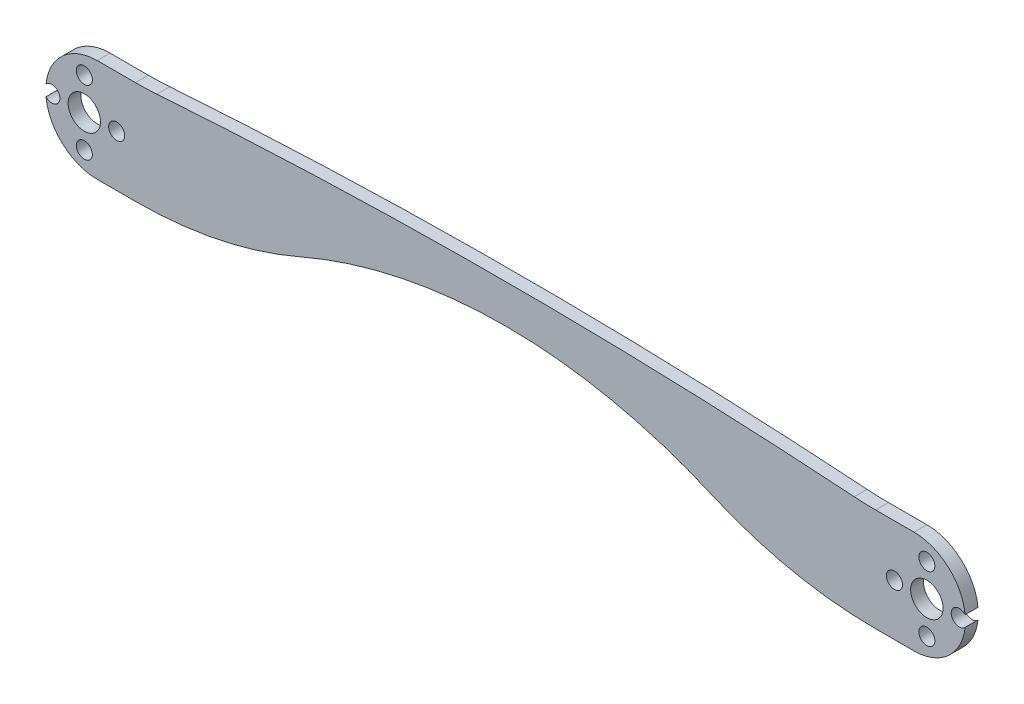
ISO-10303-21;
HEADER;
FILE_DESCRIPTION(('STEP AP214'),'2;1');
FILE_NAME('part.step','',(''),(''),'','','');
FILE_SCHEMA(('AUTOMOTIVE_DESIGN { 1 0 10303 214 1 1 1 1 }'));
ENDSEC;
DATA;
#1=APPLICATION_CONTEXT('core data for automotive mechanical design processes');
#2=APPLICATION_PROTOCOL_DEFINITION('international standard','automotive_design',2000,#1);
#3=PRODUCT_CONTEXT('',#1,'mechanical');
#4=PRODUCT('Part','Part','',(#3));
#5=PRODUCT_RELATED_PRODUCT_CATEGORY('part','',(#4));
#6=PRODUCT_DEFINITION_FORMATION('','',#4);
#7=PRODUCT_DEFINITION_CONTEXT('part definition',#1,'design');
#8=PRODUCT_DEFINITION('design','',#6,#7);
#9=PRODUCT_DEFINITION_SHAPE('','',#8);
#10=(LENGTH_UNIT() NAMED_UNIT(*) SI_UNIT(.MILLI.,.METRE.));
#11=(NAMED_UNIT(*) PLANE_ANGLE_UNIT() SI_UNIT($,.RADIAN.));
#12=(NAMED_UNIT(*) SI_UNIT($,.STERADIAN.) SOLID_ANGLE_UNIT());
#13=UNCERTAINTY_MEASURE_WITH_UNIT(LENGTH_MEASURE(1.E-05),#10,'distance_accuracy_value','');
#14=(GEOMETRIC_REPRESENTATION_CONTEXT(3) GLOBAL_UNCERTAINTY_ASSIGNED_CONTEXT((#13)) GLOBAL_UNIT_ASSIGNED_CONTEXT((#10,
#11,#12)) REPRESENTATION_CONTEXT('',''));
#15=CARTESIAN_POINT('',(0.,0.,0.));
#16=DIRECTION('',(0.,0.,1.));
#17=DIRECTION('',(1.,0.,0.));
#18=AXIS2_PLACEMENT_3D('',#15,#16,#17);
#19=CARTESIAN_POINT('',(0.,0.,3.175));
#20=DIRECTION('',(0.,0.,-1.));
#21=DIRECTION('',(-1.,0.,0.));
#22=AXIS2_PLACEMENT_3D('',#19,#20,#21);
#23=CYLINDRICAL_SURFACE('',#22,12.7);
#24=CARTESIAN_POINT('',(0.,0.,0.));
#25=DIRECTION('',(0.,0.,1.));
#26=DIRECTION('',(1.,0.,0.));
#27=AXIS2_PLACEMENT_3D('',#24,#25,#26);
#28=CIRCLE('',#27,12.7);
#29=CARTESIAN_POINT('',(0.,12.7,0.));
#30=VERTEX_POINT('',#29);
#31=CARTESIAN_POINT('',(-12.6278693896812,1.35163407664657,0.));
#32=VERTEX_POINT('',#31);
#33=EDGE_CURVE('E164',#30,#32,#28,.T.);
#34=ORIENTED_EDGE('',*,*,#33,.T.);
#35=DIRECTION('',(0.,0.,1.));
#36=VECTOR('',#35,1.);
#37=CARTESIAN_POINT('',(-12.6278693896812,1.35163407664658,1.5875));
#38=LINE('',#37,#36);
#39=CARTESIAN_POINT('',(-12.6278693896812,1.35163407664658,3.175));
#40=VERTEX_POINT('',#39);
#41=EDGE_CURVE('E50',#32,#40,#38,.T.);
#42=ORIENTED_EDGE('',*,*,#41,.T.);
#43=CARTESIAN_POINT('',(0.,0.,3.175));
#44=DIRECTION('',(0.,0.,1.));
#45=DIRECTION('',(1.,0.,0.));
#46=AXIS2_PLACEMENT_3D('',#43,#44,#45);
#47=CIRCLE('',#46,12.7);
#48=CARTESIAN_POINT('',(0.,12.7,3.175));
#49=VERTEX_POINT('',#48);
#50=EDGE_CURVE('E238',#49,#40,#47,.T.);
#51=ORIENTED_EDGE('',*,*,#50,.F.);
#52=DIRECTION('',(0.,0.,-1.));
#53=VECTOR('',#52,1.);
#54=CARTESIAN_POINT('',(0.,12.7,3.175));
#55=LINE('',#54,#53);
#56=EDGE_CURVE('E198',#49,#30,#55,.T.);
#57=ORIENTED_EDGE('',*,*,#56,.T.);
#58=EDGE_LOOP('',(#34,#42,#51,#57));
#59=FACE_BOUND('',#58,.T.);
#60=ADVANCED_FACE('F35',(#59),#23,.T.);
#61=CARTESIAN_POINT('',(201.650000052,0.,3.175));
#62=DIRECTION('',(0.,0.,-1.));
#63=DIRECTION('',(-1.,0.,0.));
#64=AXIS2_PLACEMENT_3D('',#61,#62,#63);
#65=CYLINDRICAL_SURFACE('',#64,12.7);
#66=CARTESIAN_POINT('',(201.650000052,0.,0.));
#67=DIRECTION('',(0.,0.,1.));
#68=DIRECTION('',(-1.,0.,0.));
#69=AXIS2_PLACEMENT_3D('',#66,#67,#68);
#70=CIRCLE('',#69,12.7);
#71=CARTESIAN_POINT('',(201.650000052,-12.7,0.));
#72=VERTEX_POINT('',#71);
#73=CARTESIAN_POINT('',(214.277869441681,-1.35163407664662,0.));
#74=VERTEX_POINT('',#73);
#75=EDGE_CURVE('E185',#72,#74,#70,.T.);
#76=ORIENTED_EDGE('',*,*,#75,.T.);
#77=DIRECTION('',(0.,0.,1.));
#78=VECTOR('',#77,1.);
#79=CARTESIAN_POINT('',(214.277869441681,-1.35163407664661,1.5875));
#80=LINE('',#79,#78);
#81=CARTESIAN_POINT('',(214.277869441681,-1.35163407664661,3.175));
#82=VERTEX_POINT('',#81);
#83=EDGE_CURVE('E57',#74,#82,#80,.T.);
#84=ORIENTED_EDGE('',*,*,#83,.T.);
#85=CARTESIAN_POINT('',(201.650000052,0.,3.175));
#86=DIRECTION('',(0.,0.,1.));
#87=DIRECTION('',(-1.,0.,0.));
#88=AXIS2_PLACEMENT_3D('',#85,#86,#87);
#89=CIRCLE('',#88,12.7);
#90=CARTESIAN_POINT('',(201.650000052,-12.7,3.175));
#91=VERTEX_POINT('',#90);
#92=EDGE_CURVE('E264',#91,#82,#89,.T.);
#93=ORIENTED_EDGE('',*,*,#92,.F.);
#94=DIRECTION('',(0.,0.,-1.));
#95=VECTOR('',#94,1.);
#96=CARTESIAN_POINT('',(201.650000052,-12.7,3.175));
#97=LINE('',#96,#95);
#98=EDGE_CURVE('E216',#91,#72,#97,.T.);
#99=ORIENTED_EDGE('',*,*,#98,.T.);
#100=EDGE_LOOP('',(#76,#84,#93,#99));
#101=FACE_BOUND('',#100,.T.);
#102=ADVANCED_FACE('F328',(#101),#65,.T.);
#103=CARTESIAN_POINT('',(-12.6278693896812,-1.35163407664664,3.175));
#104=VERTEX_POINT('',#103);
#105=CARTESIAN_POINT('',(0.,-12.7,3.175));
#106=VERTEX_POINT('',#105);
#107=EDGE_CURVE('E157',#104,#106,#47,.T.);
#108=ORIENTED_EDGE('',*,*,#107,.F.);
#109=DIRECTION('',(0.,0.,1.));
#110=VECTOR('',#109,1.);
#111=CARTESIAN_POINT('',(-12.6278693896812,-1.35163407664664,1.5875));
#112=LINE('',#111,#110);
#113=CARTESIAN_POINT('',(-12.6278693896812,-1.35163407664664,0.));
#114=VERTEX_POINT('',#113);
#115=EDGE_CURVE('E146',#104,#114,#112,.F.);
#116=ORIENTED_EDGE('',*,*,#115,.T.);
#117=CARTESIAN_POINT('',(0.,-12.7,0.));
#118=VERTEX_POINT('',#117);
#119=EDGE_CURVE('E155',#114,#118,#28,.T.);
#120=ORIENTED_EDGE('',*,*,#119,.T.);
#121=DIRECTION('',(0.,0.,-1.));
#122=VECTOR('',#121,1.);
#123=CARTESIAN_POINT('',(0.,-12.7,3.175));
#124=LINE('',#123,#122);
#125=EDGE_CURVE('E43',#106,#118,#124,.T.);
#126=ORIENTED_EDGE('',*,*,#125,.F.);
#127=EDGE_LOOP('',(#108,#116,#120,#126));
#128=FACE_BOUND('',#127,.T.);
#129=ADVANCED_FACE('F37',(#128),#23,.T.);
#130=CARTESIAN_POINT('',(9.46440950689287,-12.7,3.175));
#131=DIRECTION('',(0.,1.,0.));
#132=DIRECTION('',(-1.,0.,0.));
#133=AXIS2_PLACEMENT_3D('',#130,#131,#132);
#134=PLANE('',#133);
#135=DIRECTION('',(1.,0.,0.));
#136=VECTOR('',#135,1.);
#137=CARTESIAN_POINT('',(9.46440950689287,-12.7,0.));
#138=LINE('',#137,#136);
#139=CARTESIAN_POINT('',(9.46440950689287,-12.7,0.));
#140=VERTEX_POINT('',#139);
#141=EDGE_CURVE('E162',#118,#140,#138,.T.);
#142=ORIENTED_EDGE('',*,*,#141,.T.);
#143=DIRECTION('',(0.,0.,-1.));
#144=VECTOR('',#143,1.);
#145=CARTESIAN_POINT('',(9.46440950689287,-12.7,3.175));
#146=LINE('',#145,#144);
#147=CARTESIAN_POINT('',(9.46440950689287,-12.7,3.175));
#148=VERTEX_POINT('',#147);
#149=EDGE_CURVE('E228',#148,#140,#146,.T.);
#150=ORIENTED_EDGE('',*,*,#149,.F.);
#151=DIRECTION('',(1.,0.,0.));
#152=VECTOR('',#151,1.);
#153=CARTESIAN_POINT('',(9.46440950689287,-12.7,3.175));
#154=LINE('',#153,#152);
#155=EDGE_CURVE('E234',#106,#148,#154,.T.);
#156=ORIENTED_EDGE('',*,*,#155,.F.);
#157=ORIENTED_EDGE('',*,*,#125,.T.);
#158=EDGE_LOOP('',(#142,#150,#156,#157));
#159=FACE_BOUND('',#158,.T.);
#160=ADVANCED_FACE('F232',(#159),#134,.F.);
#161=CARTESIAN_POINT('',(9.46440950689286,88.9,3.175));
#162=DIRECTION('',(0.,0.,-1.));
#163=DIRECTION('',(-1.,0.,0.));
#164=AXIS2_PLACEMENT_3D('',#161,#162,#163);
#165=CYLINDRICAL_SURFACE('',#164,101.6);
#166=CARTESIAN_POINT('',(9.46440950689286,88.9,0.));
#167=DIRECTION('',(0.,0.,1.));
#168=DIRECTION('',(-1.,0.,0.));
#169=AXIS2_PLACEMENT_3D('',#166,#167,#168);
#170=CIRCLE('',#169,101.6);
#171=CARTESIAN_POINT('',(50.0691164042738,-4.23333333333338,0.));
#172=VERTEX_POINT('',#171);
#173=EDGE_CURVE('E176',#140,#172,#170,.T.);
#174=ORIENTED_EDGE('',*,*,#173,.T.);
#175=DIRECTION('',(0.,0.,-1.));
#176=VECTOR('',#175,1.);
#177=CARTESIAN_POINT('',(50.0691164042738,-4.23333333333338,3.175));
#178=LINE('',#177,#176);
#179=CARTESIAN_POINT('',(50.0691164042738,-4.23333333333338,3.175));
#180=VERTEX_POINT('',#179);
#181=EDGE_CURVE('E225',#180,#172,#178,.T.);
#182=ORIENTED_EDGE('',*,*,#181,.F.);
#183=CARTESIAN_POINT('',(9.46440950689286,88.9,3.175));
#184=DIRECTION('',(0.,0.,1.));
#185=DIRECTION('',(-1.,0.,0.));
#186=AXIS2_PLACEMENT_3D('',#183,#184,#185);
#187=CIRCLE('',#186,101.6);
#188=EDGE_CURVE('E237',#148,#180,#187,.T.);
#189=ORIENTED_EDGE('',*,*,#188,.F.);
#190=ORIENTED_EDGE('',*,*,#149,.T.);
#191=EDGE_LOOP('',(#174,#182,#189,#190));
#192=FACE_BOUND('',#191,.T.);
#193=ADVANCED_FACE('F340',(#192),#165,.T.);
#194=CARTESIAN_POINT('',(100.825000026,-120.65,3.175));
#195=DIRECTION('',(0.,0.,-1.));
#196=DIRECTION('',(-1.,0.,0.));
#197=AXIS2_PLACEMENT_3D('',#194,#195,#196);
#198=CYLINDRICAL_SURFACE('',#197,127.);
#199=CARTESIAN_POINT('',(100.825000026,-120.65,0.));
#200=DIRECTION('',(0.,0.,-1.));
#201=DIRECTION('',(-1.,0.,0.));
#202=AXIS2_PLACEMENT_3D('',#199,#200,#201);
#203=CIRCLE('',#202,127.);
#204=CARTESIAN_POINT('',(151.580883647726,-4.23333333333331,0.));
#205=VERTEX_POINT('',#204);
#206=EDGE_CURVE('E178',#172,#205,#203,.T.);
#207=ORIENTED_EDGE('',*,*,#206,.T.);
#208=DIRECTION('',(0.,0.,-1.));
#209=VECTOR('',#208,1.);
#210=CARTESIAN_POINT('',(151.580883647726,-4.23333333333331,3.175));
#211=LINE('',#210,#209);
#212=CARTESIAN_POINT('',(151.580883647726,-4.23333333333331,3.175));
#213=VERTEX_POINT('',#212);
#214=EDGE_CURVE('E222',#213,#205,#211,.T.);
#215=ORIENTED_EDGE('',*,*,#214,.F.);
#216=CARTESIAN_POINT('',(100.825000026,-120.65,3.175));
#217=DIRECTION('',(0.,0.,-1.));
#218=DIRECTION('',(-1.,0.,0.));
#219=AXIS2_PLACEMENT_3D('',#216,#217,#218);
#220=CIRCLE('',#219,127.);
#221=EDGE_CURVE('E240',#180,#213,#220,.T.);
#222=ORIENTED_EDGE('',*,*,#221,.F.);
#223=ORIENTED_EDGE('',*,*,#181,.T.);
#224=EDGE_LOOP('',(#207,#215,#222,#223));
#225=FACE_BOUND('',#224,.T.);
#226=ADVANCED_FACE('F344',(#225),#198,.F.);
#227=CARTESIAN_POINT('',(192.185590545107,88.9,3.175));
#228=DIRECTION('',(0.,0.,-1.));
#229=DIRECTION('',(-1.,0.,0.));
#230=AXIS2_PLACEMENT_3D('',#227,#228,#229);
#231=CYLINDRICAL_SURFACE('',#230,101.6);
#232=CARTESIAN_POINT('',(192.185590545107,88.9,0.));
#233=DIRECTION('',(0.,0.,1.));
#234=DIRECTION('',(1.,0.,0.));
#235=AXIS2_PLACEMENT_3D('',#232,#233,#234);
#236=CIRCLE('',#235,101.6);
#237=CARTESIAN_POINT('',(192.185590545107,-12.7,0.));
#238=VERTEX_POINT('',#237);
#239=EDGE_CURVE('E180',#205,#238,#236,.T.);
#240=ORIENTED_EDGE('',*,*,#239,.T.);
#241=DIRECTION('',(0.,0.,-1.));
#242=VECTOR('',#241,1.);
#243=CARTESIAN_POINT('',(192.185590545107,-12.7,3.175));
#244=LINE('',#243,#242);
#245=CARTESIAN_POINT('',(192.185590545107,-12.7,3.175));
#246=VERTEX_POINT('',#245);
#247=EDGE_CURVE('E219',#246,#238,#244,.T.);
#248=ORIENTED_EDGE('',*,*,#247,.F.);
#249=CARTESIAN_POINT('',(192.185590545107,88.9,3.175));
#250=DIRECTION('',(0.,0.,1.));
#251=DIRECTION('',(1.,0.,0.));
#252=AXIS2_PLACEMENT_3D('',#249,#250,#251);
#253=CIRCLE('',#252,101.6);
#254=EDGE_CURVE('E257',#213,#246,#253,.T.);
#255=ORIENTED_EDGE('',*,*,#254,.F.);
#256=ORIENTED_EDGE('',*,*,#214,.T.);
#257=EDGE_LOOP('',(#240,#248,#255,#256));
#258=FACE_BOUND('',#257,.T.);
#259=ADVANCED_FACE('F350',(#258),#231,.T.);
#260=CARTESIAN_POINT('',(201.650000052,-12.7,3.175));
#261=DIRECTION('',(0.,1.,0.));
#262=DIRECTION('',(-1.,0.,0.));
#263=AXIS2_PLACEMENT_3D('',#260,#261,#262);
#264=PLANE('',#263);
#265=DIRECTION('',(1.,0.,0.));
#266=VECTOR('',#265,1.);
#267=CARTESIAN_POINT('',(201.650000052,-12.7,0.));
#268=LINE('',#267,#266);
#269=EDGE_CURVE('E182',#238,#72,#268,.T.);
#270=ORIENTED_EDGE('',*,*,#269,.T.);
#271=ORIENTED_EDGE('',*,*,#98,.F.);
#272=DIRECTION('',(1.,0.,0.));
#273=VECTOR('',#272,1.);
#274=CARTESIAN_POINT('',(201.650000052,-12.7,3.175));
#275=LINE('',#274,#273);
#276=EDGE_CURVE('E260',#246,#91,#275,.T.);
#277=ORIENTED_EDGE('',*,*,#276,.F.);
#278=ORIENTED_EDGE('',*,*,#247,.T.);
#279=EDGE_LOOP('',(#270,#271,#277,#278));
#280=FACE_BOUND('',#279,.T.);
#281=ADVANCED_FACE('F354',(#280),#264,.F.);
#282=CARTESIAN_POINT('',(214.277869441681,1.35163407664667,3.175));
#283=VERTEX_POINT('',#282);
#284=CARTESIAN_POINT('',(201.650000052,12.7,3.175));
#285=VERTEX_POINT('',#284);
#286=EDGE_CURVE('E263',#283,#285,#89,.T.);
#287=ORIENTED_EDGE('',*,*,#286,.F.);
#288=DIRECTION('',(0.,0.,1.));
#289=VECTOR('',#288,1.);
#290=CARTESIAN_POINT('',(214.277869441681,1.35163407664667,1.5875));
#291=LINE('',#290,#289);
#292=CARTESIAN_POINT('',(214.277869441681,1.35163407664667,0.));
#293=VERTEX_POINT('',#292);
#294=EDGE_CURVE('E279',#283,#293,#291,.F.);
#295=ORIENTED_EDGE('',*,*,#294,.T.);
#296=CARTESIAN_POINT('',(201.650000052,12.7,0.));
#297=VERTEX_POINT('',#296);
#298=EDGE_CURVE('E184',#293,#297,#70,.T.);
#299=ORIENTED_EDGE('',*,*,#298,.T.);
#300=DIRECTION('',(0.,0.,-1.));
#301=VECTOR('',#300,1.);
#302=CARTESIAN_POINT('',(201.650000052,12.7,3.175));
#303=LINE('',#302,#301);
#304=EDGE_CURVE('E213',#285,#297,#303,.T.);
#305=ORIENTED_EDGE('',*,*,#304,.F.);
#306=EDGE_LOOP('',(#287,#295,#299,#305));
#307=FACE_BOUND('',#306,.T.);
#308=ADVANCED_FACE('F335',(#307),#65,.T.);
#309=CARTESIAN_POINT('',(192.185590545107,12.7,3.175));
#310=DIRECTION('',(0.,-1.,0.));
#311=DIRECTION('',(1.,0.,0.));
#312=AXIS2_PLACEMENT_3D('',#309,#310,#311);
#313=PLANE('',#312);
#314=DIRECTION('',(-1.,0.,0.));
#315=VECTOR('',#314,1.);
#316=CARTESIAN_POINT('',(192.185590545107,12.7,0.));
#317=LINE('',#316,#315);
#318=CARTESIAN_POINT('',(192.185590545107,12.7,0.));
#319=VERTEX_POINT('',#318);
#320=EDGE_CURVE('E188',#297,#319,#317,.T.);
#321=ORIENTED_EDGE('',*,*,#320,.T.);
#322=DIRECTION('',(0.,0.,-1.));
#323=VECTOR('',#322,1.);
#324=CARTESIAN_POINT('',(192.185590545107,12.7,3.175));
#325=LINE('',#324,#323);
#326=CARTESIAN_POINT('',(192.185590545107,12.7,3.175));
#327=VERTEX_POINT('',#326);
#328=EDGE_CURVE('E210',#327,#319,#325,.T.);
#329=ORIENTED_EDGE('',*,*,#328,.F.);
#330=DIRECTION('',(-1.,0.,0.));
#331=VECTOR('',#330,1.);
#332=CARTESIAN_POINT('',(192.185590545107,12.7,3.175));
#333=LINE('',#332,#331);
#334=EDGE_CURVE('E656',#285,#327,#333,.T.);
#335=ORIENTED_EDGE('',*,*,#334,.F.);
#336=ORIENTED_EDGE('',*,*,#304,.T.);
#337=EDGE_LOOP('',(#321,#329,#335,#336));
#338=FACE_BOUND('',#337,.T.);
#339=ADVANCED_FACE('F360',(#338),#313,.F.);
#340=CARTESIAN_POINT('',(192.185590545107,88.9,3.175));
#341=DIRECTION('',(0.,0.,-1.));
#342=DIRECTION('',(-1.,0.,0.));
#343=AXIS2_PLACEMENT_3D('',#340,#341,#342);
#344=CYLINDRICAL_SURFACE('',#343,76.2);
#345=CARTESIAN_POINT('',(192.185590545107,88.9,0.));
#346=DIRECTION('',(0.,0.,-1.));
#347=DIRECTION('',(1.,0.,0.));
#348=AXIS2_PLACEMENT_3D('',#345,#346,#347);
#349=CIRCLE('',#348,76.2);
#350=CARTESIAN_POINT('',(186.89571316885,12.8838359469243,0.));
#351=VERTEX_POINT('',#350);
#352=EDGE_CURVE('E190',#319,#351,#349,.T.);
#353=ORIENTED_EDGE('',*,*,#352,.T.);
#354=DIRECTION('',(0.,0.,-1.));
#355=VECTOR('',#354,1.);
#356=CARTESIAN_POINT('',(186.89571316885,12.8838359469243,3.175));
#357=LINE('',#356,#355);
#358=CARTESIAN_POINT('',(186.89571316885,12.8838359469243,3.175));
#359=VERTEX_POINT('',#358);
#360=EDGE_CURVE('E207',#359,#351,#357,.T.);
#361=ORIENTED_EDGE('',*,*,#360,.F.);
#362=CARTESIAN_POINT('',(192.185590545107,88.9,3.175));
#363=DIRECTION('',(0.,0.,-1.));
#364=DIRECTION('',(1.,0.,0.));
#365=AXIS2_PLACEMENT_3D('',#362,#363,#364);
#366=CIRCLE('',#365,76.2);
#367=EDGE_CURVE('E388',#327,#359,#366,.T.);
#368=ORIENTED_EDGE('',*,*,#367,.F.);
#369=ORIENTED_EDGE('',*,*,#328,.T.);
#370=EDGE_LOOP('',(#353,#361,#368,#369));
#371=FACE_BOUND('',#370,.T.);
#372=ADVANCED_FACE('F364',(#371),#344,.F.);
#373=CARTESIAN_POINT('',(100.825000026,-1223.96250000004,3.175));
#374=DIRECTION('',(0.,0.,-1.));
#375=DIRECTION('',(-1.,0.,0.));
#376=AXIS2_PLACEMENT_3D('',#373,#374,#375);
#377=CYLINDRICAL_SURFACE('',#376,1239.83750000004);
#378=CARTESIAN_POINT('',(100.825000026,-1223.96250000004,0.));
#379=DIRECTION('',(0.,0.,1.));
#380=DIRECTION('',(-1.,0.,0.));
#381=AXIS2_PLACEMENT_3D('',#378,#379,#380);
#382=CIRCLE('',#381,1239.83750000004);
#383=CARTESIAN_POINT('',(14.7542868831498,12.883835946924,0.));
#384=VERTEX_POINT('',#383);
#385=EDGE_CURVE('E192',#351,#384,#382,.T.);
#386=ORIENTED_EDGE('',*,*,#385,.T.);
#387=DIRECTION('',(0.,0.,-1.));
#388=VECTOR('',#387,1.);
#389=CARTESIAN_POINT('',(14.7542868831498,12.883835946924,3.175));
#390=LINE('',#389,#388);
#391=CARTESIAN_POINT('',(14.7542868831498,12.883835946924,3.175));
#392=VERTEX_POINT('',#391);
#393=EDGE_CURVE('E204',#392,#384,#390,.T.);
#394=ORIENTED_EDGE('',*,*,#393,.F.);
#395=CARTESIAN_POINT('',(100.825000026,-1223.96250000004,3.175));
#396=DIRECTION('',(0.,0.,1.));
#397=DIRECTION('',(-1.,0.,0.));
#398=AXIS2_PLACEMENT_3D('',#395,#396,#397);
#399=CIRCLE('',#398,1239.83750000004);
#400=EDGE_CURVE('E387',#359,#392,#399,.T.);
#401=ORIENTED_EDGE('',*,*,#400,.F.);
#402=ORIENTED_EDGE('',*,*,#360,.T.);
#403=EDGE_LOOP('',(#386,#394,#401,#402));
#404=FACE_BOUND('',#403,.T.);
#405=ADVANCED_FACE('F368',(#404),#377,.T.);
#406=CARTESIAN_POINT('',(9.46440950689286,88.9,3.175));
#407=DIRECTION('',(0.,0.,-1.));
#408=DIRECTION('',(-1.,0.,0.));
#409=AXIS2_PLACEMENT_3D('',#406,#407,#408);
#410=CYLINDRICAL_SURFACE('',#409,76.2);
#411=CARTESIAN_POINT('',(9.46440950689286,88.9,0.));
#412=DIRECTION('',(0.,0.,-1.));
#413=DIRECTION('',(-1.,0.,0.));
#414=AXIS2_PLACEMENT_3D('',#411,#412,#413);
#415=CIRCLE('',#414,76.2);
#416=CARTESIAN_POINT('',(9.46440950689286,12.7,0.));
#417=VERTEX_POINT('',#416);
#418=EDGE_CURVE('E194',#384,#417,#415,.T.);
#419=ORIENTED_EDGE('',*,*,#418,.T.);
#420=DIRECTION('',(0.,0.,-1.));
#421=VECTOR('',#420,1.);
#422=CARTESIAN_POINT('',(9.46440950689286,12.7,3.175));
#423=LINE('',#422,#421);
#424=CARTESIAN_POINT('',(9.46440950689286,12.7,3.175));
#425=VERTEX_POINT('',#424);
#426=EDGE_CURVE('E201',#425,#417,#423,.T.);
#427=ORIENTED_EDGE('',*,*,#426,.F.);
#428=CARTESIAN_POINT('',(9.46440950689286,88.9,3.175));
#429=DIRECTION('',(0.,0.,-1.));
#430=DIRECTION('',(-1.,0.,0.));
#431=AXIS2_PLACEMENT_3D('',#428,#429,#430);
#432=CIRCLE('',#431,76.2);
#433=EDGE_CURVE('E386',#392,#425,#432,.T.);
#434=ORIENTED_EDGE('',*,*,#433,.F.);
#435=ORIENTED_EDGE('',*,*,#393,.T.);
#436=EDGE_LOOP('',(#419,#427,#434,#435));
#437=FACE_BOUND('',#436,.T.);
#438=ADVANCED_FACE('F322',(#437),#410,.F.);
#439=CARTESIAN_POINT('',(0.,12.7,3.175));
#440=DIRECTION('',(0.,-1.,0.));
#441=DIRECTION('',(1.,0.,0.));
#442=AXIS2_PLACEMENT_3D('',#439,#440,#441);
#443=PLANE('',#442);
#444=DIRECTION('',(-1.,0.,0.));
#445=VECTOR('',#444,1.);
#446=CARTESIAN_POINT('',(0.,12.7,0.));
#447=LINE('',#446,#445);
#448=EDGE_CURVE('E196',#417,#30,#447,.T.);
#449=ORIENTED_EDGE('',*,*,#448,.T.);
#450=ORIENTED_EDGE('',*,*,#56,.F.);
#451=DIRECTION('',(-1.,0.,0.));
#452=VECTOR('',#451,1.);
#453=CARTESIAN_POINT('',(0.,12.7,3.175));
#454=LINE('',#453,#452);
#455=EDGE_CURVE('E172',#425,#49,#454,.T.);
#456=ORIENTED_EDGE('',*,*,#455,.F.);
#457=ORIENTED_EDGE('',*,*,#426,.T.);
#458=EDGE_LOOP('',(#449,#450,#456,#457));
#459=FACE_BOUND('',#458,.T.);
#460=ADVANCED_FACE('F314',(#459),#443,.F.);
#461=CARTESIAN_POINT('',(0.,0.,3.175));
#462=DIRECTION('',(0.,0.,1.));
#463=DIRECTION('',(1.,0.,0.));
#464=AXIS2_PLACEMENT_3D('',#461,#462,#463);
#465=PLANE('',#464);
#466=CARTESIAN_POINT('',(-11.175,0.,3.175));
#467=DIRECTION('',(0.,0.,1.));
#468=DIRECTION('',(1.,0.,0.));
#469=AXIS2_PLACEMENT_3D('',#466,#467,#468);
#470=CIRCLE('',#469,1.984375);
#471=EDGE_CURVE('E158',#104,#40,#470,.T.);
#472=ORIENTED_EDGE('',*,*,#471,.F.);
#473=ORIENTED_EDGE('',*,*,#107,.T.);
#474=ORIENTED_EDGE('',*,*,#155,.T.);
#475=ORIENTED_EDGE('',*,*,#188,.T.);
#476=ORIENTED_EDGE('',*,*,#221,.T.);
#477=ORIENTED_EDGE('',*,*,#254,.T.);
#478=ORIENTED_EDGE('',*,*,#276,.T.);
#479=ORIENTED_EDGE('',*,*,#92,.T.);
#480=CARTESIAN_POINT('',(212.825000052,0.,3.175));
#481=DIRECTION('',(0.,0.,1.));
#482=DIRECTION('',(1.,0.,0.));
#483=AXIS2_PLACEMENT_3D('',#480,#481,#482);
#484=CIRCLE('',#483,1.98437500000002);
#485=EDGE_CURVE('E272',#283,#82,#484,.T.);
#486=ORIENTED_EDGE('',*,*,#485,.F.);
#487=ORIENTED_EDGE('',*,*,#286,.T.);
#488=ORIENTED_EDGE('',*,*,#334,.T.);
#489=ORIENTED_EDGE('',*,*,#367,.T.);
#490=ORIENTED_EDGE('',*,*,#400,.T.);
#491=ORIENTED_EDGE('',*,*,#433,.T.);
#492=ORIENTED_EDGE('',*,*,#455,.T.);
#493=ORIENTED_EDGE('',*,*,#50,.T.);
#494=EDGE_LOOP('',(#472,#473,#474,#475,#476,#477,#478,#479,#486,#487,#488,#489,#490,#491,#492,#493));
#495=FACE_BOUND('',#494,.T.);
#496=CARTESIAN_POINT('',(-3.17499999999997,-8.,3.175));
#497=DIRECTION('',(0.,0.,1.));
#498=DIRECTION('',(1.,0.,0.));
#499=AXIS2_PLACEMENT_3D('',#496,#497,#498);
#500=CIRCLE('',#499,1.984375);
#501=CARTESIAN_POINT('',(-1.19062499999997,-8.,3.175));
#502=VERTEX_POINT('',#501);
#503=EDGE_CURVE('E402',#502,#502,#500,.T.);
#504=ORIENTED_EDGE('',*,*,#503,.F.);
#505=EDGE_LOOP('',(#504));
#506=FACE_BOUND('',#505,.T.);
#507=CARTESIAN_POINT('',(4.825,0.,3.175));
#508=DIRECTION('',(0.,0.,1.));
#509=DIRECTION('',(1.,0.,0.));
#510=AXIS2_PLACEMENT_3D('',#507,#508,#509);
#511=CIRCLE('',#510,1.984375);
#512=CARTESIAN_POINT('',(6.809375,0.,3.175));
#513=VERTEX_POINT('',#512);
#514=EDGE_CURVE('E412',#513,#513,#511,.T.);
#515=ORIENTED_EDGE('',*,*,#514,.F.);
#516=EDGE_LOOP('',(#515));
#517=FACE_BOUND('',#516,.T.);
#518=CARTESIAN_POINT('',(196.825000052,0.,3.175));
#519=DIRECTION('',(0.,0.,1.));
#520=DIRECTION('',(1.,0.,0.));
#521=AXIS2_PLACEMENT_3D('',#518,#519,#520);
#522=CIRCLE('',#521,1.98437500000002);
#523=CARTESIAN_POINT('',(198.809375052,0.,3.175));
#524=VERTEX_POINT('',#523);
#525=EDGE_CURVE('E411',#524,#524,#522,.T.);
#526=ORIENTED_EDGE('',*,*,#525,.F.);
#527=EDGE_LOOP('',(#526));
#528=FACE_BOUND('',#527,.T.);
#529=CARTESIAN_POINT('',(204.825000052,-7.99999999999998,3.175));
#530=DIRECTION('',(0.,0.,1.));
#531=DIRECTION('',(1.,0.,0.));
#532=AXIS2_PLACEMENT_3D('',#529,#530,#531);
#533=CIRCLE('',#532,1.98437500000003);
#534=CARTESIAN_POINT('',(206.809375052,-7.99999999999998,3.175));
#535=VERTEX_POINT('',#534);
#536=EDGE_CURVE('E419',#535,#535,#533,.T.);
#537=ORIENTED_EDGE('',*,*,#536,.F.);
#538=EDGE_LOOP('',(#537));
#539=FACE_BOUND('',#538,.T.);
#540=CARTESIAN_POINT('',(204.825000052,8.,3.175));
#541=DIRECTION('',(0.,0.,1.));
#542=DIRECTION('',(1.,0.,0.));
#543=AXIS2_PLACEMENT_3D('',#540,#541,#542);
#544=CIRCLE('',#543,1.98437500000002);
#545=CARTESIAN_POINT('',(206.809375052,8.,3.175));
#546=VERTEX_POINT('',#545);
#547=EDGE_CURVE('E283',#546,#546,#544,.T.);
#548=ORIENTED_EDGE('',*,*,#547,.F.);
#549=EDGE_LOOP('',(#548));
#550=FACE_BOUND('',#549,.T.);
#551=CARTESIAN_POINT('',(204.825000052,0.,3.175));
#552=DIRECTION('',(0.,0.,1.));
#553=DIRECTION('',(1.,0.,0.));
#554=AXIS2_PLACEMENT_3D('',#551,#552,#553);
#555=CIRCLE('',#554,3.99999999999999);
#556=CARTESIAN_POINT('',(208.825000052,0.,3.175));
#557=VERTEX_POINT('',#556);
#558=EDGE_CURVE('E287',#557,#557,#555,.T.);
#559=ORIENTED_EDGE('',*,*,#558,.F.);
#560=EDGE_LOOP('',(#559));
#561=FACE_BOUND('',#560,.T.);
#562=CARTESIAN_POINT('',(-3.175,0.,3.175));
#563=DIRECTION('',(0.,0.,1.));
#564=DIRECTION('',(1.,0.,0.));
#565=AXIS2_PLACEMENT_3D('',#562,#563,#564);
#566=CIRCLE('',#565,4.);
#567=CARTESIAN_POINT('',(0.824999999999999,0.,3.175));
#568=VERTEX_POINT('',#567);
#569=EDGE_CURVE('E303',#568,#568,#566,.T.);
#570=ORIENTED_EDGE('',*,*,#569,.F.);
#571=EDGE_LOOP('',(#570));
#572=FACE_BOUND('',#571,.T.);
#573=CARTESIAN_POINT('',(-3.17500000000003,8.,3.175));
#574=DIRECTION('',(0.,0.,1.));
#575=DIRECTION('',(1.,0.,0.));
#576=AXIS2_PLACEMENT_3D('',#573,#574,#575);
#577=CIRCLE('',#576,1.984375);
#578=CARTESIAN_POINT('',(-1.19062500000003,8.,3.175));
#579=VERTEX_POINT('',#578);
#580=EDGE_CURVE('E168',#579,#579,#577,.T.);
#581=ORIENTED_EDGE('',*,*,#580,.F.);
#582=EDGE_LOOP('',(#581));
#583=FACE_BOUND('',#582,.T.);
#584=ADVANCED_FACE('F312',(#495,#506,#517,#528,#539,#550,#561,#572,#583),#465,.T.);
#585=CARTESIAN_POINT('',(0.,0.,0.));
#586=DIRECTION('',(0.,0.,1.));
#587=DIRECTION('',(1.,0.,0.));
#588=AXIS2_PLACEMENT_3D('',#585,#586,#587);
#589=PLANE('',#588);
#590=CARTESIAN_POINT('',(-3.17499999999997,-8.,0.));
#591=DIRECTION('',(0.,0.,1.));
#592=DIRECTION('',(1.,0.,0.));
#593=AXIS2_PLACEMENT_3D('',#590,#591,#592);
#594=CIRCLE('',#593,1.984375);
#595=CARTESIAN_POINT('',(-1.19062499999997,-8.,0.));
#596=VERTEX_POINT('',#595);
#597=EDGE_CURVE('E407',#596,#596,#594,.T.);
#598=ORIENTED_EDGE('',*,*,#597,.T.);
#599=EDGE_LOOP('',(#598));
#600=FACE_BOUND('',#599,.T.);
#601=CARTESIAN_POINT('',(4.825,0.,0.));
#602=DIRECTION('',(0.,0.,1.));
#603=DIRECTION('',(1.,0.,0.));
#604=AXIS2_PLACEMENT_3D('',#601,#602,#603);
#605=CIRCLE('',#604,1.984375);
#606=CARTESIAN_POINT('',(6.809375,0.,0.));
#607=VERTEX_POINT('',#606);
#608=EDGE_CURVE('E409',#607,#607,#605,.T.);
#609=ORIENTED_EDGE('',*,*,#608,.T.);
#610=EDGE_LOOP('',(#609));
#611=FACE_BOUND('',#610,.T.);
#612=CARTESIAN_POINT('',(196.825000052,0.,0.));
#613=DIRECTION('',(0.,0.,1.));
#614=DIRECTION('',(1.,0.,0.));
#615=AXIS2_PLACEMENT_3D('',#612,#613,#614);
#616=CIRCLE('',#615,1.98437500000002);
#617=CARTESIAN_POINT('',(198.809375052,0.,0.));
#618=VERTEX_POINT('',#617);
#619=EDGE_CURVE('E416',#618,#618,#616,.T.);
#620=ORIENTED_EDGE('',*,*,#619,.T.);
#621=EDGE_LOOP('',(#620));
#622=FACE_BOUND('',#621,.T.);
#623=CARTESIAN_POINT('',(204.825000052,-7.99999999999998,0.));
#624=DIRECTION('',(0.,0.,1.));
#625=DIRECTION('',(1.,0.,0.));
#626=AXIS2_PLACEMENT_3D('',#623,#624,#625);
#627=CIRCLE('',#626,1.98437500000003);
#628=CARTESIAN_POINT('',(206.809375052,-7.99999999999998,0.));
#629=VERTEX_POINT('',#628);
#630=EDGE_CURVE('E277',#629,#629,#627,.T.);
#631=ORIENTED_EDGE('',*,*,#630,.T.);
#632=EDGE_LOOP('',(#631));
#633=FACE_BOUND('',#632,.T.);
#634=CARTESIAN_POINT('',(204.825000052,8.,0.));
#635=DIRECTION('',(0.,0.,1.));
#636=DIRECTION('',(1.,0.,0.));
#637=AXIS2_PLACEMENT_3D('',#634,#635,#636);
#638=CIRCLE('',#637,1.98437500000002);
#639=CARTESIAN_POINT('',(206.809375052,8.,0.));
#640=VERTEX_POINT('',#639);
#641=EDGE_CURVE('E284',#640,#640,#638,.T.);
#642=ORIENTED_EDGE('',*,*,#641,.T.);
#643=EDGE_LOOP('',(#642));
#644=FACE_BOUND('',#643,.T.);
#645=CARTESIAN_POINT('',(204.825000052,0.,0.));
#646=DIRECTION('',(0.,0.,1.));
#647=DIRECTION('',(1.,0.,0.));
#648=AXIS2_PLACEMENT_3D('',#645,#646,#647);
#649=CIRCLE('',#648,3.99999999999999);
#650=CARTESIAN_POINT('',(208.825000052,0.,0.));
#651=VERTEX_POINT('',#650);
#652=EDGE_CURVE('E291',#651,#651,#649,.T.);
#653=ORIENTED_EDGE('',*,*,#652,.T.);
#654=EDGE_LOOP('',(#653));
#655=FACE_BOUND('',#654,.T.);
#656=CARTESIAN_POINT('',(-3.175,0.,0.));
#657=DIRECTION('',(0.,0.,1.));
#658=DIRECTION('',(1.,0.,0.));
#659=AXIS2_PLACEMENT_3D('',#656,#657,#658);
#660=CIRCLE('',#659,4.);
#661=CARTESIAN_POINT('',(0.824999999999999,0.,0.));
#662=VERTEX_POINT('',#661);
#663=EDGE_CURVE('E301',#662,#662,#660,.T.);
#664=ORIENTED_EDGE('',*,*,#663,.T.);
#665=EDGE_LOOP('',(#664));
#666=FACE_BOUND('',#665,.T.);
#667=CARTESIAN_POINT('',(-3.17500000000003,8.,0.));
#668=DIRECTION('',(0.,0.,1.));
#669=DIRECTION('',(1.,0.,0.));
#670=AXIS2_PLACEMENT_3D('',#667,#668,#669);
#671=CIRCLE('',#670,1.984375);
#672=CARTESIAN_POINT('',(-1.19062500000003,8.,0.));
#673=VERTEX_POINT('',#672);
#674=EDGE_CURVE('E165',#673,#673,#671,.T.);
#675=ORIENTED_EDGE('',*,*,#674,.T.);
#676=EDGE_LOOP('',(#675));
#677=FACE_BOUND('',#676,.T.);
#678=ORIENTED_EDGE('',*,*,#119,.F.);
#679=CARTESIAN_POINT('',(-11.175,0.,0.));
#680=DIRECTION('',(0.,0.,1.));
#681=DIRECTION('',(1.,0.,0.));
#682=AXIS2_PLACEMENT_3D('',#679,#680,#681);
#683=CIRCLE('',#682,1.984375);
#684=EDGE_CURVE('E12',#114,#32,#683,.T.);
#685=ORIENTED_EDGE('',*,*,#684,.T.);
#686=ORIENTED_EDGE('',*,*,#33,.F.);
#687=ORIENTED_EDGE('',*,*,#448,.F.);
#688=ORIENTED_EDGE('',*,*,#418,.F.);
#689=ORIENTED_EDGE('',*,*,#385,.F.);
#690=ORIENTED_EDGE('',*,*,#352,.F.);
#691=ORIENTED_EDGE('',*,*,#320,.F.);
#692=ORIENTED_EDGE('',*,*,#298,.F.);
#693=CARTESIAN_POINT('',(212.825000052,0.,0.));
#694=DIRECTION('',(0.,0.,1.));
#695=DIRECTION('',(1.,0.,0.));
#696=AXIS2_PLACEMENT_3D('',#693,#694,#695);
#697=CIRCLE('',#696,1.98437500000002);
#698=EDGE_CURVE('E276',#293,#74,#697,.T.);
#699=ORIENTED_EDGE('',*,*,#698,.T.);
#700=ORIENTED_EDGE('',*,*,#75,.F.);
#701=ORIENTED_EDGE('',*,*,#269,.F.);
#702=ORIENTED_EDGE('',*,*,#239,.F.);
#703=ORIENTED_EDGE('',*,*,#206,.F.);
#704=ORIENTED_EDGE('',*,*,#173,.F.);
#705=ORIENTED_EDGE('',*,*,#141,.F.);
#706=EDGE_LOOP('',(#678,#685,#686,#687,#688,#689,#690,#691,#692,#699,#700,#701,#702,#703,#704,#705));
#707=FACE_BOUND('',#706,.T.);
#708=ADVANCED_FACE('F160',(#600,#611,#622,#633,#644,#655,#666,#677,#707),#589,.F.);
#709=CARTESIAN_POINT('',(-3.17500000000003,8.,0.));
#710=DIRECTION('',(0.,0.,1.));
#711=DIRECTION('',(1.,0.,0.));
#712=AXIS2_PLACEMENT_3D('',#709,#710,#711);
#713=CYLINDRICAL_SURFACE('',#712,1.984375);
#714=ORIENTED_EDGE('',*,*,#674,.F.);
#715=EDGE_LOOP('',(#714));
#716=FACE_BOUND('',#715,.T.);
#717=ORIENTED_EDGE('',*,*,#580,.T.);
#718=EDGE_LOOP('',(#717));
#719=FACE_BOUND('',#718,.T.);
#720=ADVANCED_FACE('F310',(#716,#719),#713,.F.);
#721=CARTESIAN_POINT('',(-3.175,0.,0.));
#722=DIRECTION('',(0.,0.,1.));
#723=DIRECTION('',(1.,0.,0.));
#724=AXIS2_PLACEMENT_3D('',#721,#722,#723);
#725=CYLINDRICAL_SURFACE('',#724,4.);
#726=ORIENTED_EDGE('',*,*,#663,.F.);
#727=EDGE_LOOP('',(#726));
#728=FACE_BOUND('',#727,.T.);
#729=ORIENTED_EDGE('',*,*,#569,.T.);
#730=EDGE_LOOP('',(#729));
#731=FACE_BOUND('',#730,.T.);
#732=ADVANCED_FACE('F437',(#728,#731),#725,.F.);
#733=CARTESIAN_POINT('',(204.825000052,0.,0.));
#734=DIRECTION('',(0.,0.,1.));
#735=DIRECTION('',(1.,0.,0.));
#736=AXIS2_PLACEMENT_3D('',#733,#734,#735);
#737=CYLINDRICAL_SURFACE('',#736,3.99999999999999);
#738=ORIENTED_EDGE('',*,*,#652,.F.);
#739=EDGE_LOOP('',(#738));
#740=FACE_BOUND('',#739,.T.);
#741=ORIENTED_EDGE('',*,*,#558,.T.);
#742=EDGE_LOOP('',(#741));
#743=FACE_BOUND('',#742,.T.);
#744=ADVANCED_FACE('F439',(#740,#743),#737,.F.);
#745=CARTESIAN_POINT('',(204.825000052,8.,0.));
#746=DIRECTION('',(0.,0.,1.));
#747=DIRECTION('',(1.,0.,0.));
#748=AXIS2_PLACEMENT_3D('',#745,#746,#747);
#749=CYLINDRICAL_SURFACE('',#748,1.98437500000002);
#750=ORIENTED_EDGE('',*,*,#641,.F.);
#751=EDGE_LOOP('',(#750));
#752=FACE_BOUND('',#751,.T.);
#753=ORIENTED_EDGE('',*,*,#547,.T.);
#754=EDGE_LOOP('',(#753));
#755=FACE_BOUND('',#754,.T.);
#756=ADVANCED_FACE('F446',(#752,#755),#749,.F.);
#757=CARTESIAN_POINT('',(212.825000052,0.,0.));
#758=DIRECTION('',(0.,0.,1.));
#759=DIRECTION('',(1.,0.,0.));
#760=AXIS2_PLACEMENT_3D('',#757,#758,#759);
#761=CYLINDRICAL_SURFACE('',#760,1.98437500000002);
#762=ORIENTED_EDGE('',*,*,#698,.F.);
#763=ORIENTED_EDGE('',*,*,#294,.F.);
#764=ORIENTED_EDGE('',*,*,#485,.T.);
#765=ORIENTED_EDGE('',*,*,#83,.F.);
#766=EDGE_LOOP('',(#762,#763,#764,#765));
#767=FACE_BOUND('',#766,.T.);
#768=ADVANCED_FACE('F454',(#767),#761,.F.);
#769=CARTESIAN_POINT('',(204.825000052,-7.99999999999998,0.));
#770=DIRECTION('',(0.,0.,1.));
#771=DIRECTION('',(1.,0.,0.));
#772=AXIS2_PLACEMENT_3D('',#769,#770,#771);
#773=CYLINDRICAL_SURFACE('',#772,1.98437500000003);
#774=ORIENTED_EDGE('',*,*,#630,.F.);
#775=EDGE_LOOP('',(#774));
#776=FACE_BOUND('',#775,.T.);
#777=ORIENTED_EDGE('',*,*,#536,.T.);
#778=EDGE_LOOP('',(#777));
#779=FACE_BOUND('',#778,.T.);
#780=ADVANCED_FACE('F428',(#776,#779),#773,.F.);
#781=CARTESIAN_POINT('',(196.825000052,0.,0.));
#782=DIRECTION('',(0.,0.,1.));
#783=DIRECTION('',(1.,0.,0.));
#784=AXIS2_PLACEMENT_3D('',#781,#782,#783);
#785=CYLINDRICAL_SURFACE('',#784,1.98437500000002);
#786=ORIENTED_EDGE('',*,*,#619,.F.);
#787=EDGE_LOOP('',(#786));
#788=FACE_BOUND('',#787,.T.);
#789=ORIENTED_EDGE('',*,*,#525,.T.);
#790=EDGE_LOOP('',(#789));
#791=FACE_BOUND('',#790,.T.);
#792=ADVANCED_FACE('F460',(#788,#791),#785,.F.);
#793=CARTESIAN_POINT('',(4.825,0.,0.));
#794=DIRECTION('',(0.,0.,1.));
#795=DIRECTION('',(1.,0.,0.));
#796=AXIS2_PLACEMENT_3D('',#793,#794,#795);
#797=CYLINDRICAL_SURFACE('',#796,1.984375);
#798=ORIENTED_EDGE('',*,*,#608,.F.);
#799=EDGE_LOOP('',(#798));
#800=FACE_BOUND('',#799,.T.);
#801=ORIENTED_EDGE('',*,*,#514,.T.);
#802=EDGE_LOOP('',(#801));
#803=FACE_BOUND('',#802,.T.);
#804=ADVANCED_FACE('F464',(#800,#803),#797,.F.);
#805=CARTESIAN_POINT('',(-3.17499999999997,-8.,0.));
#806=DIRECTION('',(0.,0.,1.));
#807=DIRECTION('',(1.,0.,0.));
#808=AXIS2_PLACEMENT_3D('',#805,#806,#807);
#809=CYLINDRICAL_SURFACE('',#808,1.984375);
#810=ORIENTED_EDGE('',*,*,#597,.F.);
#811=EDGE_LOOP('',(#810));
#812=FACE_BOUND('',#811,.T.);
#813=ORIENTED_EDGE('',*,*,#503,.T.);
#814=EDGE_LOOP('',(#813));
#815=FACE_BOUND('',#814,.T.);
#816=ADVANCED_FACE('F468',(#812,#815),#809,.F.);
#817=CARTESIAN_POINT('',(-11.175,0.,0.));
#818=DIRECTION('',(0.,0.,1.));
#819=DIRECTION('',(1.,0.,0.));
#820=AXIS2_PLACEMENT_3D('',#817,#818,#819);
#821=CYLINDRICAL_SURFACE('',#820,1.984375);
#822=ORIENTED_EDGE('',*,*,#684,.F.);
#823=ORIENTED_EDGE('',*,*,#115,.F.);
#824=ORIENTED_EDGE('',*,*,#471,.T.);
#825=ORIENTED_EDGE('',*,*,#41,.F.);
#826=EDGE_LOOP('',(#822,#823,#824,#825));
#827=FACE_BOUND('',#826,.T.);
#828=ADVANCED_FACE('F145',(#827),#821,.F.);
#829=CLOSED_SHELL('',(#60,#102,#129,#160,#193,#226,#259,#281,#308,#339,#372,#405,#438,#460,#584,
#708,#720,#732,#744,#756,#768,#780,#792,#804,#816,#828));
#830=MANIFOLD_SOLID_BREP('B2',#829);
#831=ADVANCED_BREP_SHAPE_REPRESENTATION('',(#18,#830),#14);
#832=SHAPE_DEFINITION_REPRESENTATION(#9,#831);
ENDSEC;
END-ISO-10303-21;
